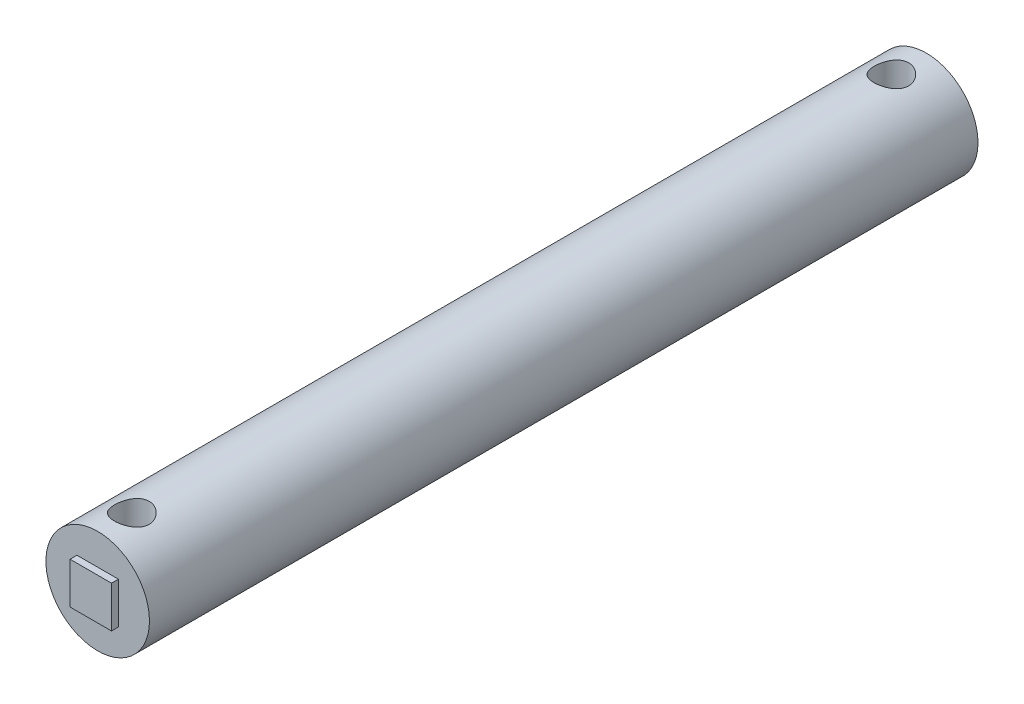
ISO-10303-21;
HEADER;
FILE_DESCRIPTION(('STEP AP214'),'2;1');
FILE_NAME('part.step','',(''),(''),'','','');
FILE_SCHEMA(('AUTOMOTIVE_DESIGN { 1 0 10303 214 1 1 1 1 }'));
ENDSEC;
DATA;
#1=APPLICATION_CONTEXT('core data for automotive mechanical design processes');
#2=APPLICATION_PROTOCOL_DEFINITION('international standard','automotive_design',2000,#1);
#3=PRODUCT_CONTEXT('',#1,'mechanical');
#4=PRODUCT('Part','Part','',(#3));
#5=PRODUCT_RELATED_PRODUCT_CATEGORY('part','',(#4));
#6=PRODUCT_DEFINITION_FORMATION('','',#4);
#7=PRODUCT_DEFINITION_CONTEXT('part definition',#1,'design');
#8=PRODUCT_DEFINITION('design','',#6,#7);
#9=PRODUCT_DEFINITION_SHAPE('','',#8);
#10=(LENGTH_UNIT() NAMED_UNIT(*) SI_UNIT(.MILLI.,.METRE.));
#11=(NAMED_UNIT(*) PLANE_ANGLE_UNIT() SI_UNIT($,.RADIAN.));
#12=(NAMED_UNIT(*) SI_UNIT($,.STERADIAN.) SOLID_ANGLE_UNIT());
#13=UNCERTAINTY_MEASURE_WITH_UNIT(LENGTH_MEASURE(1.E-05),#10,'distance_accuracy_value','');
#14=(GEOMETRIC_REPRESENTATION_CONTEXT(3) GLOBAL_UNCERTAINTY_ASSIGNED_CONTEXT((#13)) GLOBAL_UNIT_ASSIGNED_CONTEXT((#10,
#11,#12)) REPRESENTATION_CONTEXT('',''));
#15=CARTESIAN_POINT('',(0.,0.,0.));
#16=DIRECTION('',(0.,0.,1.));
#17=DIRECTION('',(1.,0.,0.));
#18=AXIS2_PLACEMENT_3D('',#15,#16,#17);
#19=CARTESIAN_POINT('',(0.,0.,60.));
#20=DIRECTION('',(0.,0.,-1.));
#21=DIRECTION('',(-1.,0.,0.));
#22=AXIS2_PLACEMENT_3D('',#19,#20,#21);
#23=CYLINDRICAL_SURFACE('',#22,7.5);
#24=CARTESIAN_POINT('',(2.44548962202173,7.09010440745297,115.));
#25=CARTESIAN_POINT('',(2.44549022489282,7.09010399158785,115.13639194743));
#26=CARTESIAN_POINT('',(2.43429071197438,7.09399673344019,115.272780243976));
#27=CARTESIAN_POINT('',(2.38993391279918,7.10906127410884,115.541523148788));
#28=CARTESIAN_POINT('',(2.35677313743169,7.12023422956957,115.673877112601));
#29=CARTESIAN_POINT('',(2.26977176414744,7.14844063378442,115.930622167149));
#30=CARTESIAN_POINT('',(2.21597015629796,7.1654630267975,116.055027758425));
#31=CARTESIAN_POINT('',(2.08934177443543,7.20340224421352,116.293092114063));
#32=CARTESIAN_POINT('',(2.01651089069817,7.22431990959193,116.406748549715));
#33=CARTESIAN_POINT('',(1.85095347245155,7.26853096468038,116.624354715124));
#34=CARTESIAN_POINT('',(1.75763330927719,7.29188103540003,116.727841431005));
#35=CARTESIAN_POINT('',(1.55500738388795,7.33776050614127,116.918010037244));
#36=CARTESIAN_POINT('',(1.44569927887343,7.36028978528245,117.004689460403));
#37=CARTESIAN_POINT('',(1.2109692056893,7.4025730580127,117.160760524351));
#38=CARTESIAN_POINT('',(1.08522579609347,7.42224829192345,117.229691915553));
#39=CARTESIAN_POINT('',(0.823161350143599,7.45585839282917,117.345246921666));
#40=CARTESIAN_POINT('',(0.68684322862981,7.46979483504472,117.391876658646));
#41=CARTESIAN_POINT('',(0.4126030442508,7.48985898254732,117.459889309561));
#42=CARTESIAN_POINT('',(0.274906075525262,7.49624412402236,117.482102609449));
#43=CARTESIAN_POINT('',(-0.00239025035411809,7.50128017614413,117.503319122196));
#44=CARTESIAN_POINT('',(-0.141989133421975,7.49993298025629,117.502328017079));
#45=CARTESIAN_POINT('',(-0.413573557882291,7.48977600308497,117.477694740615));
#46=CARTESIAN_POINT('',(-0.545648242696176,7.48124808485107,117.454903743357));
#47=CARTESIAN_POINT('',(-0.803947464109366,7.45791492488888,117.388749195508));
#48=CARTESIAN_POINT('',(-0.93017154885925,7.44310919921052,117.345384058847));
#49=CARTESIAN_POINT('',(-1.17542351309193,7.40837131189626,117.23868567036));
#50=CARTESIAN_POINT('',(-1.29431235086316,7.38836443881961,117.175058083416));
#51=CARTESIAN_POINT('',(-1.51997789988009,7.3452627587628,117.029881507955));
#52=CARTESIAN_POINT('',(-1.62675112718097,7.32216706770583,116.948327384216));
#53=CARTESIAN_POINT('',(-1.83057863879854,7.27395899041506,116.765009088026));
#54=CARTESIAN_POINT('',(-1.92692004190617,7.24880301897135,116.662462506802));
#55=CARTESIAN_POINT('',(-2.10125174746113,7.20020497610945,116.442413525832));
#56=CARTESIAN_POINT('',(-2.17923926629671,7.17676316503772,116.324908861652));
#57=CARTESIAN_POINT('',(-2.31552096142186,7.13397168411738,116.076193479134));
#58=CARTESIAN_POINT('',(-2.37354333743111,7.11467973815026,115.944823164307));
#59=CARTESIAN_POINT('',(-2.46638890271202,7.08303331303905,115.673347576634));
#60=CARTESIAN_POINT('',(-2.50122240574045,7.07067575006161,115.533246217474));
#61=CARTESIAN_POINT('',(-2.54520764292867,7.05495856309845,115.255446587488));
#62=CARTESIAN_POINT('',(-2.55550478809578,7.05119797792599,115.11795228751));
#63=CARTESIAN_POINT('',(-2.55336489271969,7.05197367185134,114.843179582597));
#64=CARTESIAN_POINT('',(-2.54093209201698,7.05650840361514,114.705901142179));
#65=CARTESIAN_POINT('',(-2.49469693464315,7.07298000520337,114.440545245723));
#66=CARTESIAN_POINT('',(-2.46167014462677,7.0846479402767,114.312314191716));
#67=CARTESIAN_POINT('',(-2.37611223081313,7.11379780932038,114.063243273428));
#68=CARTESIAN_POINT('',(-2.32357757619856,7.13128079572361,113.94240475177));
#69=CARTESIAN_POINT('',(-2.19852414714674,7.17083790960198,113.707119688578));
#70=CARTESIAN_POINT('',(-2.12540165401872,7.19304480808356,113.593016940712));
#71=CARTESIAN_POINT('',(-1.96194569674786,7.23933516292333,113.378300588077));
#72=CARTESIAN_POINT('',(-1.87160697732508,7.26341919094806,113.277691118169));
#73=CARTESIAN_POINT('',(-1.67086899539885,7.31227591777891,113.087555651541));
#74=CARTESIAN_POINT('',(-1.55968626362084,7.33702184669254,112.998847501519));
#75=CARTESIAN_POINT('',(-1.32342110908038,7.38329377082801,112.841291510042));
#76=CARTESIAN_POINT('',(-1.19833899382816,7.40481983726143,112.772443229328));
#77=CARTESIAN_POINT('',(-0.938234823790851,7.44223552717528,112.657105018691));
#78=CARTESIAN_POINT('',(-0.803268004154795,7.45815395764301,112.610500368921));
#79=CARTESIAN_POINT('',(-0.526760889959159,7.48276379089851,112.540877235034));
#80=CARTESIAN_POINT('',(-0.38522303395312,7.4914578524143,112.517850073155));
#81=CARTESIAN_POINT('',(-0.10686265311105,7.5004698666747,112.496840788176));
#82=CARTESIAN_POINT('',(0.0298621000756927,7.50116813862013,112.497714713752));
#83=CARTESIAN_POINT('',(0.301170903663914,7.49517865490161,112.521687662539));
#84=CARTESIAN_POINT('',(0.435755150824566,7.48849158213902,112.544784630825));
#85=CARTESIAN_POINT('',(0.696539697144409,7.46871113716691,112.611751613715));
#86=CARTESIAN_POINT('',(0.822846962464736,7.45573460945831,112.655242295593));
#87=CARTESIAN_POINT('',(1.06644072417718,7.42480946813606,112.761444124562));
#88=CARTESIAN_POINT('',(1.18372565428804,7.4068599936943,112.824158599533));
#89=CARTESIAN_POINT('',(1.41046977121198,7.36710923714644,112.969578897944));
#90=CARTESIAN_POINT('',(1.51950571915653,7.34519421778484,113.052913081802));
#91=CARTESIAN_POINT('',(1.72242098955527,7.30027986905304,113.236136757535));
#92=CARTESIAN_POINT('',(1.81629557036969,7.2772802033596,113.336031408895));
#93=CARTESIAN_POINT('',(1.98995212670324,7.23176840182728,113.554193519779));
#94=CARTESIAN_POINT('',(2.06904027392138,7.20931041492086,113.673026286671));
#95=CARTESIAN_POINT('',(2.20608486621925,7.16856512489781,113.922963570356));
#96=CARTESIAN_POINT('',(2.26404642024053,7.15027681384981,114.054065110601));
#97=CARTESIAN_POINT('',(2.35490928722307,7.12085667779552,114.319197210166));
#98=CARTESIAN_POINT('',(2.3887669319706,7.10945485829763,114.452869297742));
#99=CARTESIAN_POINT('',(2.43405309060397,7.09408016011375,114.724363089999));
#100=CARTESIAN_POINT('',(2.44548901285352,7.09010482766189,114.862183408775));
#101=CARTESIAN_POINT('',(2.44548962202173,7.09010440745297,115.));
#102=B_SPLINE_CURVE_WITH_KNOTS('',3,(#24,#25,#26,#27,#28,#29,#30,#31,#32,#33,#34,#35,#36,#37,
#38,#39,#40,#41,#42,#43,#44,#45,#46,#47,#48,#49,#50,#51,#52,#53,#54,#55,#56,#57,#58,#59,#60,#61,
#62,#63,#64,#65,#66,#67,#68,#69,#70,#71,#72,#73,#74,#75,#76,#77,#78,#79,#80,#81,#82,#83,#84,#85,
#86,#87,#88,#89,#90,#91,#92,#93,#94,#95,#96,#97,#98,#99,#100,#101),.UNSPECIFIED.,.T.,.F.,(4,2,2,
2,2,2,2,2,2,2,2,2,2,2,2,2,2,2,2,2,2,2,2,2,2,2,2,2,2,2,2,2,2,2,2,2,2,2,4),(0.,0.408666423219487,
0.817397789180034,1.22536084238349,1.63341207568901,2.05537445189343,2.47739872259067,
2.90946129115628,3.34140518521897,3.75815500010449,4.17480276723174,4.57581954452084,
4.97686724142531,5.38402890391776,5.79130735400781,6.21814264244295,6.64504262449434,
7.07754352039463,7.50985192334124,7.92154604151629,8.33316337379327,8.73014463325997,
9.12719777922344,9.53738861730053,9.94770486791145,10.3787720534343,10.8098297039168,
11.2386395189751,11.6672914525279,12.0754648597695,12.4836005275617,12.884428777574,
13.2853264552439,13.700396784995,14.1155966755397,14.5470171461539,14.9783332191223,
15.3914047587577,15.8043397923661),.UNSPECIFIED.);
#103=CARTESIAN_POINT('',(2.44548962202173,7.09010440745297,115.));
#104=VERTEX_POINT('',#103);
#105=EDGE_CURVE('E39',#104,#104,#102,.T.);
#106=ORIENTED_EDGE('',*,*,#105,.T.);
#107=EDGE_LOOP('',(#106));
#108=FACE_BOUND('',#107,.T.);
#109=CARTESIAN_POINT('',(2.44548962202173,-7.09010440745297,115.));
#110=CARTESIAN_POINT('',(2.44549022489282,-7.09010399158785,114.86360805257));
#111=CARTESIAN_POINT('',(2.43429071197437,-7.09399673344019,114.727219756024));
#112=CARTESIAN_POINT('',(2.38993391279918,-7.10906127410884,114.458476851212));
#113=CARTESIAN_POINT('',(2.35677313743169,-7.12023422956957,114.326122887399));
#114=CARTESIAN_POINT('',(2.26977176414743,-7.14844063378442,114.069377832851));
#115=CARTESIAN_POINT('',(2.21597015629796,-7.1654630267975,113.944972241575));
#116=CARTESIAN_POINT('',(2.08934177443543,-7.20340224421352,113.706907885937));
#117=CARTESIAN_POINT('',(2.01651089069817,-7.22431990959193,113.593251450285));
#118=CARTESIAN_POINT('',(1.85095347245155,-7.26853096468038,113.375645284876));
#119=CARTESIAN_POINT('',(1.75763330927718,-7.29188103540003,113.272158568995));
#120=CARTESIAN_POINT('',(1.55500738388794,-7.33776050614128,113.081989962756));
#121=CARTESIAN_POINT('',(1.44569927887343,-7.36028978528245,112.995310539597));
#122=CARTESIAN_POINT('',(1.2109692056893,-7.4025730580127,112.839239475649));
#123=CARTESIAN_POINT('',(1.08522579609347,-7.42224829192345,112.770308084447));
#124=CARTESIAN_POINT('',(0.823161350143598,-7.45585839282917,112.654753078334));
#125=CARTESIAN_POINT('',(0.686843228629809,-7.46979483504472,112.608123341354));
#126=CARTESIAN_POINT('',(0.412603044250799,-7.48985898254732,112.540110690439));
#127=CARTESIAN_POINT('',(0.27490607552526,-7.49624412402236,112.517897390551));
#128=CARTESIAN_POINT('',(-0.00239025035412009,-7.50128017614413,112.496680877804));
#129=CARTESIAN_POINT('',(-0.141989133421976,-7.49993298025629,112.497671982921));
#130=CARTESIAN_POINT('',(-0.413573557882292,-7.48977600308497,112.522305259385));
#131=CARTESIAN_POINT('',(-0.545648242696178,-7.48124808485107,112.545096256643));
#132=CARTESIAN_POINT('',(-0.803947464109367,-7.45791492488888,112.611250804492));
#133=CARTESIAN_POINT('',(-0.930171548859251,-7.44310919921052,112.654615941153));
#134=CARTESIAN_POINT('',(-1.17542351309193,-7.40837131189626,112.76131432964));
#135=CARTESIAN_POINT('',(-1.29431235086316,-7.38836443881961,112.824941916584));
#136=CARTESIAN_POINT('',(-1.51997789988009,-7.3452627587628,112.970118492045));
#137=CARTESIAN_POINT('',(-1.62675112718097,-7.32216706770583,113.051672615784));
#138=CARTESIAN_POINT('',(-1.83057863879854,-7.27395899041506,113.234990911974));
#139=CARTESIAN_POINT('',(-1.92692004190616,-7.24880301897135,113.337537493198));
#140=CARTESIAN_POINT('',(-2.10125174746112,-7.20020497610945,113.557586474168));
#141=CARTESIAN_POINT('',(-2.17923926629671,-7.17676316503772,113.675091138348));
#142=CARTESIAN_POINT('',(-2.31552096142186,-7.13397168411738,113.923806520866));
#143=CARTESIAN_POINT('',(-2.37354333743111,-7.11467973815026,114.055176835693));
#144=CARTESIAN_POINT('',(-2.46638890271202,-7.08303331303905,114.326652423366));
#145=CARTESIAN_POINT('',(-2.50122240574045,-7.07067575006161,114.466753782526));
#146=CARTESIAN_POINT('',(-2.54520764292867,-7.05495856309845,114.744553412512));
#147=CARTESIAN_POINT('',(-2.55550478809578,-7.05119797792599,114.88204771249));
#148=CARTESIAN_POINT('',(-2.55336489271969,-7.05197367185134,115.156820417403));
#149=CARTESIAN_POINT('',(-2.54093209201698,-7.05650840361514,115.294098857821));
#150=CARTESIAN_POINT('',(-2.49469693464315,-7.07298000520337,115.559454754277));
#151=CARTESIAN_POINT('',(-2.46167014462677,-7.08464794027671,115.687685808284));
#152=CARTESIAN_POINT('',(-2.37611223081313,-7.11379780932039,115.936756726572));
#153=CARTESIAN_POINT('',(-2.32357757619856,-7.13128079572361,116.05759524823));
#154=CARTESIAN_POINT('',(-2.19852414714674,-7.17083790960198,116.292880311422));
#155=CARTESIAN_POINT('',(-2.12540165401872,-7.19304480808356,116.406983059288));
#156=CARTESIAN_POINT('',(-1.96194569674786,-7.23933516292333,116.621699411923));
#157=CARTESIAN_POINT('',(-1.87160697732508,-7.26341919094806,116.722308881831));
#158=CARTESIAN_POINT('',(-1.67086899539885,-7.31227591777891,116.912444348459));
#159=CARTESIAN_POINT('',(-1.55968626362084,-7.33702184669254,117.001152498481));
#160=CARTESIAN_POINT('',(-1.32342110908039,-7.38329377082801,117.158708489958));
#161=CARTESIAN_POINT('',(-1.19833899382816,-7.40481983726143,117.227556770672));
#162=CARTESIAN_POINT('',(-0.938234823790852,-7.44223552717528,117.342894981309));
#163=CARTESIAN_POINT('',(-0.803268004154796,-7.45815395764301,117.389499631079));
#164=CARTESIAN_POINT('',(-0.52676088995916,-7.48276379089851,117.459122764966));
#165=CARTESIAN_POINT('',(-0.385223033953121,-7.4914578524143,117.482149926845));
#166=CARTESIAN_POINT('',(-0.106862653111051,-7.5004698666747,117.503159211824));
#167=CARTESIAN_POINT('',(0.0298621000756914,-7.50116813862013,117.502285286248));
#168=CARTESIAN_POINT('',(0.301170903663913,-7.49517865490161,117.478312337461));
#169=CARTESIAN_POINT('',(0.435755150824565,-7.48849158213902,117.455215369175));
#170=CARTESIAN_POINT('',(0.696539697144408,-7.46871113716691,117.388248386285));
#171=CARTESIAN_POINT('',(0.822846962464734,-7.45573460945831,117.344757704407));
#172=CARTESIAN_POINT('',(1.06644072417718,-7.42480946813606,117.238555875438));
#173=CARTESIAN_POINT('',(1.18372565428804,-7.4068599936943,117.175841400467));
#174=CARTESIAN_POINT('',(1.41046977121198,-7.36710923714644,117.030421102056));
#175=CARTESIAN_POINT('',(1.51950571915653,-7.34519421778484,116.947086918198));
#176=CARTESIAN_POINT('',(1.72242098955527,-7.30027986905304,116.763863242465));
#177=CARTESIAN_POINT('',(1.81629557036969,-7.2772802033596,116.663968591105));
#178=CARTESIAN_POINT('',(1.98995212670324,-7.23176840182728,116.445806480221));
#179=CARTESIAN_POINT('',(2.06904027392138,-7.20931041492086,116.326973713329));
#180=CARTESIAN_POINT('',(2.20608486621925,-7.16856512489781,116.077036429644));
#181=CARTESIAN_POINT('',(2.26404642024053,-7.15027681384981,115.945934889399));
#182=CARTESIAN_POINT('',(2.35490928722306,-7.12085667779552,115.680802789834));
#183=CARTESIAN_POINT('',(2.3887669319706,-7.10945485829763,115.547130702258));
#184=CARTESIAN_POINT('',(2.43405309060397,-7.09408016011375,115.275636910001));
#185=CARTESIAN_POINT('',(2.44548901285352,-7.09010482766189,115.137816591225));
#186=CARTESIAN_POINT('',(2.44548962202173,-7.09010440745297,115.));
#187=B_SPLINE_CURVE_WITH_KNOTS('',3,(#109,#110,#111,#112,#113,#114,#115,#116,#117,#118,#119,
#120,#121,#122,#123,#124,#125,#126,#127,#128,#129,#130,#131,#132,#133,#134,#135,#136,#137,#138,
#139,#140,#141,#142,#143,#144,#145,#146,#147,#148,#149,#150,#151,#152,#153,#154,#155,#156,#157,
#158,#159,#160,#161,#162,#163,#164,#165,#166,#167,#168,#169,#170,#171,#172,#173,#174,#175,#176,
#177,#178,#179,#180,#181,#182,#183,#184,#185,#186),.UNSPECIFIED.,.T.,.F.,(4,2,2,2,2,2,2,2,2,2,2,
2,2,2,2,2,2,2,2,2,2,2,2,2,2,2,2,2,2,2,2,2,2,2,2,2,2,2,4),(0.,0.408666423219487,
0.817397789180034,1.22536084238349,1.63341207568901,2.05537445189344,2.47739872259067,
2.90946129115628,3.34140518521897,3.75815500010449,4.17480276723174,4.57581954452084,
4.97686724142531,5.38402890391777,5.79130735400781,6.21814264244293,6.64504262449434,
7.07754352039463,7.50985192334124,7.92154604151629,8.33316337379327,8.73014463325998,
9.12719777922343,9.53738861730053,9.94770486791145,10.3787720534343,10.8098297039168,
11.2386395189751,11.6672914525279,12.0754648597695,12.4836005275617,12.884428777574,
13.2853264552439,13.700396784995,14.1155966755397,14.5470171461539,14.9783332191223,
15.3914047587577,15.8043397923661),.UNSPECIFIED.);
#188=CARTESIAN_POINT('',(2.44548962202173,-7.09010440745297,115.));
#189=VERTEX_POINT('',#188);
#190=EDGE_CURVE('E12',#189,#189,#187,.T.);
#191=ORIENTED_EDGE('',*,*,#190,.T.);
#192=EDGE_LOOP('',(#191));
#193=FACE_BOUND('',#192,.T.);
#194=CARTESIAN_POINT('',(2.44548962202173,-7.09010440745297,5.));
#195=CARTESIAN_POINT('',(2.44549022489282,-7.09010399158785,5.13639194743031));
#196=CARTESIAN_POINT('',(2.43429071197437,-7.09399673344019,5.27278024397561));
#197=CARTESIAN_POINT('',(2.38993391279918,-7.10906127410884,5.54152314878753));
#198=CARTESIAN_POINT('',(2.35677313743169,-7.12023422956957,5.67387711260106));
#199=CARTESIAN_POINT('',(2.26977176414743,-7.14844063378442,5.93062216714861));
#200=CARTESIAN_POINT('',(2.21597015629795,-7.1654630267975,6.05502775842536));
#201=CARTESIAN_POINT('',(2.08934177443543,-7.20340224421353,6.29309211406347));
#202=CARTESIAN_POINT('',(2.01651089069816,-7.22431990959193,6.40674854971531));
#203=CARTESIAN_POINT('',(1.85095347245154,-7.26853096468038,6.62435471512369));
#204=CARTESIAN_POINT('',(1.75763330927717,-7.29188103540003,6.7278414310049));
#205=CARTESIAN_POINT('',(1.55500738388793,-7.33776050614128,6.9180100372445));
#206=CARTESIAN_POINT('',(1.44569927887342,-7.36028978528246,7.00468946040261));
#207=CARTESIAN_POINT('',(1.21096920568929,-7.4025730580127,7.16076052435056));
#208=CARTESIAN_POINT('',(1.08522579609346,-7.42224829192345,7.22969191555345));
#209=CARTESIAN_POINT('',(0.823161350143589,-7.45585839282917,7.34524692166592));
#210=CARTESIAN_POINT('',(0.686843228629803,-7.46979483504472,7.39187665864566));
#211=CARTESIAN_POINT('',(0.412603044250796,-7.48985898254732,7.45988930956071));
#212=CARTESIAN_POINT('',(0.274906075525258,-7.49624412402236,7.48210260944859));
#213=CARTESIAN_POINT('',(-0.00239025035412093,-7.50128017614413,7.50331912219593));
#214=CARTESIAN_POINT('',(-0.141989133421976,-7.49993298025629,7.50232801707899));
#215=CARTESIAN_POINT('',(-0.413573557882292,-7.48977600308497,7.47769474061521));
#216=CARTESIAN_POINT('',(-0.545648242696178,-7.48124808485106,7.45490374335685));
#217=CARTESIAN_POINT('',(-0.803947464109368,-7.45791492488887,7.38874919550846));
#218=CARTESIAN_POINT('',(-0.930171548859252,-7.44310919921052,7.34538405884736));
#219=CARTESIAN_POINT('',(-1.17542351309193,-7.40837131189626,7.23868567036026));
#220=CARTESIAN_POINT('',(-1.29431235086316,-7.38836443881961,7.17505808341564));
#221=CARTESIAN_POINT('',(-1.51997789988009,-7.3452627587628,7.02988150795489));
#222=CARTESIAN_POINT('',(-1.62675112718097,-7.32216706770583,6.94832738421558));
#223=CARTESIAN_POINT('',(-1.83057863879854,-7.27395899041506,6.76500908802565));
#224=CARTESIAN_POINT('',(-1.92692004190617,-7.24880301897135,6.66246250680167));
#225=CARTESIAN_POINT('',(-2.10125174746114,-7.20020497610945,6.4424135258318));
#226=CARTESIAN_POINT('',(-2.17923926629672,-7.17676316503772,6.32490886165159));
#227=CARTESIAN_POINT('',(-2.31552096142186,-7.13397168411738,6.07619347913402));
#228=CARTESIAN_POINT('',(-2.37354333743111,-7.11467973815026,5.94482316430727));
#229=CARTESIAN_POINT('',(-2.46638890271202,-7.08303331303905,5.6733475766341));
#230=CARTESIAN_POINT('',(-2.50122240574045,-7.07067575006161,5.53324621747375));
#231=CARTESIAN_POINT('',(-2.54520764292867,-7.05495856309845,5.25544658748839));
#232=CARTESIAN_POINT('',(-2.55550478809578,-7.05119797792599,5.1179522875096));
#233=CARTESIAN_POINT('',(-2.55336489271969,-7.05197367185134,4.84317958259682));
#234=CARTESIAN_POINT('',(-2.54093209201698,-7.05650840361514,4.70590114217878));
#235=CARTESIAN_POINT('',(-2.49469693464315,-7.07298000520337,4.44054524572253));
#236=CARTESIAN_POINT('',(-2.46167014462677,-7.0846479402767,4.31231419171557));
#237=CARTESIAN_POINT('',(-2.37611223081313,-7.11379780932038,4.06324327342803));
#238=CARTESIAN_POINT('',(-2.32357757619856,-7.13128079572361,3.94240475176996));
#239=CARTESIAN_POINT('',(-2.19852414714674,-7.17083790960198,3.70711968857802));
#240=CARTESIAN_POINT('',(-2.12540165401872,-7.19304480808356,3.59301694071223));
#241=CARTESIAN_POINT('',(-1.96194569674786,-7.23933516292333,3.3783005880766));
#242=CARTESIAN_POINT('',(-1.87160697732508,-7.26341919094806,3.27769111816937));
#243=CARTESIAN_POINT('',(-1.67086899539885,-7.31227591777891,3.08755565154133));
#244=CARTESIAN_POINT('',(-1.55968626362083,-7.33702184669255,2.99884750151911));
#245=CARTESIAN_POINT('',(-1.32342110908038,-7.38329377082801,2.84129151004178));
#246=CARTESIAN_POINT('',(-1.19833899382815,-7.40481983726143,2.77244322932768));
#247=CARTESIAN_POINT('',(-0.938234823790843,-7.44223552717528,2.65710501869135));
#248=CARTESIAN_POINT('',(-0.803268004154789,-7.45815395764302,2.61050036892064));
#249=CARTESIAN_POINT('',(-0.526760889959158,-7.48276379089851,2.54087723503441));
#250=CARTESIAN_POINT('',(-0.385223033953122,-7.4914578524143,2.51785007315525));
#251=CARTESIAN_POINT('',(-0.106862653111053,-7.5004698666747,2.4968407881757));
#252=CARTESIAN_POINT('',(0.0298621000756898,-7.50116813862013,2.49771471375203));
#253=CARTESIAN_POINT('',(0.301170903663912,-7.49517865490161,2.52168766253943));
#254=CARTESIAN_POINT('',(0.435755150824563,-7.48849158213902,2.54478463082486));
#255=CARTESIAN_POINT('',(0.696539697144407,-7.46871113716691,2.61175161371507));
#256=CARTESIAN_POINT('',(0.822846962464735,-7.45573460945831,2.65524229559347));
#257=CARTESIAN_POINT('',(1.06644072417718,-7.42480946813606,2.76144412456193));
#258=CARTESIAN_POINT('',(1.18372565428804,-7.4068599936943,2.82415859953339));
#259=CARTESIAN_POINT('',(1.41046977121198,-7.36710923714644,2.96957889794373));
#260=CARTESIAN_POINT('',(1.51950571915653,-7.34519421778484,3.0529130818016));
#261=CARTESIAN_POINT('',(1.72242098955527,-7.30027986905304,3.23613675753537));
#262=CARTESIAN_POINT('',(1.81629557036969,-7.2772802033596,3.33603140889522));
#263=CARTESIAN_POINT('',(1.98995212670324,-7.23176840182728,3.55419351977918));
#264=CARTESIAN_POINT('',(2.06904027392138,-7.20931041492086,3.67302628667051));
#265=CARTESIAN_POINT('',(2.20608486621925,-7.16856512489781,3.92296357035552));
#266=CARTESIAN_POINT('',(2.26404642024053,-7.15027681384981,4.05406511060094));
#267=CARTESIAN_POINT('',(2.35490928722307,-7.12085667779552,4.31919721016551));
#268=CARTESIAN_POINT('',(2.3887669319706,-7.10945485829762,4.45286929774164));
#269=CARTESIAN_POINT('',(2.43405309060397,-7.09408016011375,4.72436308999891));
#270=CARTESIAN_POINT('',(2.44548901285352,-7.09010482766189,4.86218340877541));
#271=CARTESIAN_POINT('',(2.44548962202173,-7.09010440745297,5.));
#272=B_SPLINE_CURVE_WITH_KNOTS('',3,(#194,#195,#196,#197,#198,#199,#200,#201,#202,#203,#204,
#205,#206,#207,#208,#209,#210,#211,#212,#213,#214,#215,#216,#217,#218,#219,#220,#221,#222,#223,
#224,#225,#226,#227,#228,#229,#230,#231,#232,#233,#234,#235,#236,#237,#238,#239,#240,#241,#242,
#243,#244,#245,#246,#247,#248,#249,#250,#251,#252,#253,#254,#255,#256,#257,#258,#259,#260,#261,
#262,#263,#264,#265,#266,#267,#268,#269,#270,#271),.UNSPECIFIED.,.T.,.F.,(4,2,2,2,2,2,2,2,2,2,2,
2,2,2,2,2,2,2,2,2,2,2,2,2,2,2,2,2,2,2,2,2,2,2,2,2,2,2,4),(0.,0.408666423219492,
0.817397789180036,1.22536084238349,1.63341207568902,2.05537445189345,2.47739872259068,
2.90946129115629,3.34140518521898,3.75815500010449,4.17480276723174,4.57581954452084,
4.97686724142531,5.38402890391776,5.79130735400782,6.21814264244295,6.64504262449435,
7.07754352039462,7.50985192334123,7.92154604151629,8.33316337379325,8.73014463325997,
9.12719777922344,9.53738861730053,9.94770486791146,10.3787720534343,10.8098297039169,
11.2386395189751,11.6672914525279,12.0754648597695,12.4836005275617,12.884428777574,
13.2853264552439,13.700396784995,14.1155966755397,14.5470171461539,14.9783332191223,
15.3914047587577,15.8043397923661),.UNSPECIFIED.);
#273=CARTESIAN_POINT('',(2.44548962202173,-7.09010440745297,5.));
#274=VERTEX_POINT('',#273);
#275=EDGE_CURVE('E47',#274,#274,#272,.T.);
#276=ORIENTED_EDGE('',*,*,#275,.F.);
#277=EDGE_LOOP('',(#276));
#278=FACE_BOUND('',#277,.T.);
#279=CARTESIAN_POINT('',(0.,0.,0.));
#280=DIRECTION('',(0.,0.,1.));
#281=DIRECTION('',(1.,0.,0.));
#282=AXIS2_PLACEMENT_3D('',#279,#280,#281);
#283=CIRCLE('',#282,7.5);
#284=CARTESIAN_POINT('',(7.5,0.,0.));
#285=VERTEX_POINT('',#284);
#286=EDGE_CURVE('E178',#285,#285,#283,.T.);
#287=ORIENTED_EDGE('',*,*,#286,.T.);
#288=EDGE_LOOP('',(#287));
#289=FACE_BOUND('',#288,.T.);
#290=CARTESIAN_POINT('',(2.44548962202173,7.09010440745297,5.));
#291=CARTESIAN_POINT('',(2.44549022489282,7.09010399158785,4.86360805256969));
#292=CARTESIAN_POINT('',(2.43429071197438,7.09399673344019,4.72721975602439));
#293=CARTESIAN_POINT('',(2.38993391279918,7.10906127410884,4.45847685121247));
#294=CARTESIAN_POINT('',(2.35677313743169,7.12023422956957,4.32612288739894));
#295=CARTESIAN_POINT('',(2.26977176414743,7.14844063378442,4.06937783285139));
#296=CARTESIAN_POINT('',(2.21597015629795,7.1654630267975,3.94497224157464));
#297=CARTESIAN_POINT('',(2.08934177443543,7.20340224421352,3.70690788593653));
#298=CARTESIAN_POINT('',(2.01651089069816,7.22431990959193,3.59325145028469));
#299=CARTESIAN_POINT('',(1.85095347245154,7.26853096468038,3.37564528487631));
#300=CARTESIAN_POINT('',(1.75763330927717,7.29188103540003,3.2721585689951));
#301=CARTESIAN_POINT('',(1.55500738388793,7.33776050614128,3.0819899627555));
#302=CARTESIAN_POINT('',(1.44569927887342,7.36028978528246,2.99531053959739));
#303=CARTESIAN_POINT('',(1.21096920568929,7.4025730580127,2.83923947564944));
#304=CARTESIAN_POINT('',(1.08522579609346,7.42224829192345,2.77030808444655));
#305=CARTESIAN_POINT('',(0.823161350143589,7.45585839282917,2.65475307833408));
#306=CARTESIAN_POINT('',(0.686843228629804,7.46979483504472,2.60812334135434));
#307=CARTESIAN_POINT('',(0.412603044250797,7.48985898254732,2.54011069043929));
#308=CARTESIAN_POINT('',(0.274906075525259,7.49624412402236,2.51789739055141));
#309=CARTESIAN_POINT('',(-0.00239025035412009,7.50128017614413,2.49668087780407));
#310=CARTESIAN_POINT('',(-0.141989133421976,7.49993298025629,2.49767198292101));
#311=CARTESIAN_POINT('',(-0.413573557882291,7.48977600308497,2.52230525938479));
#312=CARTESIAN_POINT('',(-0.545648242696177,7.48124808485107,2.54509625664315));
#313=CARTESIAN_POINT('',(-0.803947464109367,7.45791492488887,2.61125080449154));
#314=CARTESIAN_POINT('',(-0.930171548859251,7.44310919921052,2.65461594115264));
#315=CARTESIAN_POINT('',(-1.17542351309193,7.40837131189626,2.76131432963974));
#316=CARTESIAN_POINT('',(-1.29431235086316,7.38836443881961,2.82494191658436));
#317=CARTESIAN_POINT('',(-1.51997789988009,7.3452627587628,2.97011849204512));
#318=CARTESIAN_POINT('',(-1.62675112718097,7.32216706770583,3.05167261578442));
#319=CARTESIAN_POINT('',(-1.83057863879854,7.27395899041506,3.23499091197435));
#320=CARTESIAN_POINT('',(-1.92692004190617,7.24880301897135,3.33753749319834));
#321=CARTESIAN_POINT('',(-2.10125174746114,7.20020497610945,3.5575864741682));
#322=CARTESIAN_POINT('',(-2.17923926629672,7.17676316503772,3.67509113834841));
#323=CARTESIAN_POINT('',(-2.31552096142186,7.13397168411738,3.92380652086598));
#324=CARTESIAN_POINT('',(-2.37354333743111,7.11467973815026,4.05517683569273));
#325=CARTESIAN_POINT('',(-2.46638890271202,7.08303331303905,4.3266524233659));
#326=CARTESIAN_POINT('',(-2.50122240574045,7.07067575006161,4.46675378252625));
#327=CARTESIAN_POINT('',(-2.54520764292867,7.05495856309845,4.74455341251161));
#328=CARTESIAN_POINT('',(-2.55550478809578,7.05119797792599,4.8820477124904));
#329=CARTESIAN_POINT('',(-2.55336489271969,7.05197367185134,5.15682041740318));
#330=CARTESIAN_POINT('',(-2.54093209201698,7.05650840361514,5.29409885782122));
#331=CARTESIAN_POINT('',(-2.49469693464315,7.07298000520337,5.55945475427747));
#332=CARTESIAN_POINT('',(-2.46167014462677,7.0846479402767,5.68768580828444));
#333=CARTESIAN_POINT('',(-2.37611223081313,7.11379780932038,5.93675672657197));
#334=CARTESIAN_POINT('',(-2.32357757619856,7.13128079572361,6.05759524823004));
#335=CARTESIAN_POINT('',(-2.19852414714674,7.17083790960198,6.29288031142199));
#336=CARTESIAN_POINT('',(-2.12540165401872,7.19304480808356,6.40698305928778));
#337=CARTESIAN_POINT('',(-1.96194569674786,7.23933516292333,6.6216994119234));
#338=CARTESIAN_POINT('',(-1.87160697732507,7.26341919094806,6.72230888183063));
#339=CARTESIAN_POINT('',(-1.67086899539885,7.31227591777891,6.91244434845867));
#340=CARTESIAN_POINT('',(-1.55968626362083,7.33702184669255,7.00115249848089));
#341=CARTESIAN_POINT('',(-1.32342110908038,7.38329377082801,7.15870848995822));
#342=CARTESIAN_POINT('',(-1.19833899382815,7.40481983726143,7.22755677067232));
#343=CARTESIAN_POINT('',(-0.938234823790843,7.44223552717528,7.34289498130865));
#344=CARTESIAN_POINT('',(-0.803268004154789,7.45815395764302,7.38949963107936));
#345=CARTESIAN_POINT('',(-0.526760889959157,7.48276379089851,7.45912276496559));
#346=CARTESIAN_POINT('',(-0.385223033953121,7.4914578524143,7.48214992684475));
#347=CARTESIAN_POINT('',(-0.106862653111053,7.5004698666747,7.5031592118243));
#348=CARTESIAN_POINT('',(0.0298621000756906,7.50116813862013,7.50228528624797));
#349=CARTESIAN_POINT('',(0.301170903663912,7.49517865490161,7.47831233746057));
#350=CARTESIAN_POINT('',(0.435755150824563,7.48849158213902,7.45521536917514));
#351=CARTESIAN_POINT('',(0.696539697144408,7.46871113716691,7.38824838628493));
#352=CARTESIAN_POINT('',(0.822846962464736,7.45573460945831,7.34475770440653));
#353=CARTESIAN_POINT('',(1.06644072417718,7.42480946813606,7.23855587543807));
#354=CARTESIAN_POINT('',(1.18372565428804,7.4068599936943,7.17584140046661));
#355=CARTESIAN_POINT('',(1.41046977121198,7.36710923714644,7.03042110205627));
#356=CARTESIAN_POINT('',(1.51950571915653,7.34519421778484,6.9470869181984));
#357=CARTESIAN_POINT('',(1.72242098955527,7.30027986905304,6.76386324246463));
#358=CARTESIAN_POINT('',(1.81629557036969,7.2772802033596,6.66396859110479));
#359=CARTESIAN_POINT('',(1.98995212670324,7.23176840182728,6.44580648022082));
#360=CARTESIAN_POINT('',(2.06904027392138,7.20931041492086,6.32697371332948));
#361=CARTESIAN_POINT('',(2.20608486621925,7.1685651248978,6.07703642964448));
#362=CARTESIAN_POINT('',(2.26404642024053,7.15027681384981,5.94593488939905));
#363=CARTESIAN_POINT('',(2.35490928722307,7.12085667779552,5.68080278983449));
#364=CARTESIAN_POINT('',(2.3887669319706,7.10945485829762,5.54713070225836));
#365=CARTESIAN_POINT('',(2.43405309060397,7.09408016011375,5.27563691000109));
#366=CARTESIAN_POINT('',(2.44548901285352,7.09010482766189,5.13781659122459));
#367=CARTESIAN_POINT('',(2.44548962202173,7.09010440745297,5.));
#368=B_SPLINE_CURVE_WITH_KNOTS('',3,(#290,#291,#292,#293,#294,#295,#296,#297,#298,#299,#300,
#301,#302,#303,#304,#305,#306,#307,#308,#309,#310,#311,#312,#313,#314,#315,#316,#317,#318,#319,
#320,#321,#322,#323,#324,#325,#326,#327,#328,#329,#330,#331,#332,#333,#334,#335,#336,#337,#338,
#339,#340,#341,#342,#343,#344,#345,#346,#347,#348,#349,#350,#351,#352,#353,#354,#355,#356,#357,
#358,#359,#360,#361,#362,#363,#364,#365,#366,#367),.UNSPECIFIED.,.T.,.F.,(4,2,2,2,2,2,2,2,2,2,2,
2,2,2,2,2,2,2,2,2,2,2,2,2,2,2,2,2,2,2,2,2,2,2,2,2,2,2,4),(0.,0.408666423219492,
0.817397789180036,1.22536084238349,1.63341207568902,2.05537445189346,2.47739872259069,
2.90946129115629,3.34140518521898,3.75815500010449,4.17480276723174,4.57581954452084,
4.97686724142531,5.38402890391776,5.79130735400781,6.21814264244295,6.64504262449435,
7.07754352039462,7.50985192334123,7.92154604151629,8.33316337379325,8.73014463325997,
9.12719777922344,9.53738861730053,9.94770486791146,10.3787720534343,10.8098297039169,
11.2386395189751,11.6672914525279,12.0754648597695,12.4836005275617,12.884428777574,
13.2853264552439,13.700396784995,14.1155966755397,14.5470171461539,14.9783332191223,
15.3914047587577,15.8043397923661),.UNSPECIFIED.);
#369=CARTESIAN_POINT('',(2.44548962202173,7.09010440745297,5.));
#370=VERTEX_POINT('',#369);
#371=EDGE_CURVE('E147',#370,#370,#368,.T.);
#372=ORIENTED_EDGE('',*,*,#371,.F.);
#373=EDGE_LOOP('',(#372));
#374=FACE_BOUND('',#373,.T.);
#375=CARTESIAN_POINT('',(0.,0.,120.));
#376=DIRECTION('',(0.,0.,1.));
#377=DIRECTION('',(1.,0.,0.));
#378=AXIS2_PLACEMENT_3D('',#375,#376,#377);
#379=CIRCLE('',#378,7.5);
#380=CARTESIAN_POINT('',(7.5,0.,120.));
#381=VERTEX_POINT('',#380);
#382=EDGE_CURVE('E115',#381,#381,#379,.T.);
#383=ORIENTED_EDGE('',*,*,#382,.F.);
#384=EDGE_LOOP('',(#383));
#385=FACE_BOUND('',#384,.T.);
#386=ADVANCED_FACE('F35',(#108,#193,#278,#289,#374,#385),#23,.T.);
#387=CARTESIAN_POINT('',(0.,0.,0.));
#388=DIRECTION('',(0.,0.,1.));
#389=DIRECTION('',(1.,0.,0.));
#390=AXIS2_PLACEMENT_3D('',#387,#388,#389);
#391=PLANE('',#390);
#392=ORIENTED_EDGE('',*,*,#286,.F.);
#393=EDGE_LOOP('',(#392));
#394=FACE_BOUND('',#393,.T.);
#395=DIRECTION('',(0.,-1.,0.));
#396=VECTOR('',#395,1.);
#397=CARTESIAN_POINT('',(3.,3.,0.));
#398=LINE('',#397,#396);
#399=CARTESIAN_POINT('',(3.,3.,0.));
#400=VERTEX_POINT('',#399);
#401=CARTESIAN_POINT('',(3.,-3.,0.));
#402=VERTEX_POINT('',#401);
#403=EDGE_CURVE('E159',#400,#402,#398,.T.);
#404=ORIENTED_EDGE('',*,*,#403,.F.);
#405=DIRECTION('',(1.,0.,0.));
#406=VECTOR('',#405,1.);
#407=CARTESIAN_POINT('',(3.,3.,0.));
#408=LINE('',#407,#406);
#409=CARTESIAN_POINT('',(-3.,3.,0.));
#410=VERTEX_POINT('',#409);
#411=EDGE_CURVE('E152',#410,#400,#408,.T.);
#412=ORIENTED_EDGE('',*,*,#411,.F.);
#413=DIRECTION('',(0.,1.,0.));
#414=VECTOR('',#413,1.);
#415=CARTESIAN_POINT('',(-3.,3.,0.));
#416=LINE('',#415,#414);
#417=CARTESIAN_POINT('',(-3.,-3.,0.));
#418=VERTEX_POINT('',#417);
#419=EDGE_CURVE('E163',#418,#410,#416,.T.);
#420=ORIENTED_EDGE('',*,*,#419,.F.);
#421=DIRECTION('',(-1.,0.,0.));
#422=VECTOR('',#421,1.);
#423=CARTESIAN_POINT('',(3.,-3.,0.));
#424=LINE('',#423,#422);
#425=EDGE_CURVE('E62',#402,#418,#424,.T.);
#426=ORIENTED_EDGE('',*,*,#425,.F.);
#427=EDGE_LOOP('',(#404,#412,#420,#426));
#428=FACE_BOUND('',#427,.T.);
#429=ADVANCED_FACE('F215',(#394,#428),#391,.F.);
#430=CARTESIAN_POINT('',(3.,3.,-1.));
#431=DIRECTION('',(-1.,0.,0.));
#432=DIRECTION('',(0.,-1.,0.));
#433=AXIS2_PLACEMENT_3D('',#430,#431,#432);
#434=PLANE('',#433);
#435=ORIENTED_EDGE('',*,*,#403,.T.);
#436=DIRECTION('',(0.,0.,1.));
#437=VECTOR('',#436,1.);
#438=CARTESIAN_POINT('',(3.,-3.,-1.));
#439=LINE('',#438,#437);
#440=CARTESIAN_POINT('',(3.,-3.,-1.));
#441=VERTEX_POINT('',#440);
#442=EDGE_CURVE('E176',#441,#402,#439,.T.);
#443=ORIENTED_EDGE('',*,*,#442,.F.);
#444=DIRECTION('',(0.,-1.,0.));
#445=VECTOR('',#444,1.);
#446=CARTESIAN_POINT('',(3.,3.,-1.));
#447=LINE('',#446,#445);
#448=CARTESIAN_POINT('',(3.,3.,-1.));
#449=VERTEX_POINT('',#448);
#450=EDGE_CURVE('E148',#449,#441,#447,.T.);
#451=ORIENTED_EDGE('',*,*,#450,.F.);
#452=DIRECTION('',(0.,0.,1.));
#453=VECTOR('',#452,1.);
#454=CARTESIAN_POINT('',(3.,3.,-1.));
#455=LINE('',#454,#453);
#456=EDGE_CURVE('E158',#449,#400,#455,.T.);
#457=ORIENTED_EDGE('',*,*,#456,.T.);
#458=EDGE_LOOP('',(#435,#443,#451,#457));
#459=FACE_BOUND('',#458,.T.);
#460=ADVANCED_FACE('F212',(#459),#434,.F.);
#461=CARTESIAN_POINT('',(3.,-3.,-1.));
#462=DIRECTION('',(0.,1.,0.));
#463=DIRECTION('',(0.,0.,1.));
#464=AXIS2_PLACEMENT_3D('',#461,#462,#463);
#465=PLANE('',#464);
#466=ORIENTED_EDGE('',*,*,#425,.T.);
#467=DIRECTION('',(0.,0.,1.));
#468=VECTOR('',#467,1.);
#469=CARTESIAN_POINT('',(-3.,-3.,-1.));
#470=LINE('',#469,#468);
#471=CARTESIAN_POINT('',(-3.,-3.,-1.));
#472=VERTEX_POINT('',#471);
#473=EDGE_CURVE('E173',#472,#418,#470,.T.);
#474=ORIENTED_EDGE('',*,*,#473,.F.);
#475=DIRECTION('',(-1.,0.,0.));
#476=VECTOR('',#475,1.);
#477=CARTESIAN_POINT('',(3.,-3.,-1.));
#478=LINE('',#477,#476);
#479=EDGE_CURVE('E151',#441,#472,#478,.T.);
#480=ORIENTED_EDGE('',*,*,#479,.F.);
#481=ORIENTED_EDGE('',*,*,#442,.T.);
#482=EDGE_LOOP('',(#466,#474,#480,#481));
#483=FACE_BOUND('',#482,.T.);
#484=ADVANCED_FACE('F208',(#483),#465,.F.);
#485=CARTESIAN_POINT('',(-3.,3.,-1.));
#486=DIRECTION('',(1.,0.,0.));
#487=DIRECTION('',(0.,1.,0.));
#488=AXIS2_PLACEMENT_3D('',#485,#486,#487);
#489=PLANE('',#488);
#490=ORIENTED_EDGE('',*,*,#419,.T.);
#491=DIRECTION('',(0.,0.,1.));
#492=VECTOR('',#491,1.);
#493=CARTESIAN_POINT('',(-3.,3.,-1.));
#494=LINE('',#493,#492);
#495=CARTESIAN_POINT('',(-3.,3.,-1.));
#496=VERTEX_POINT('',#495);
#497=EDGE_CURVE('E170',#496,#410,#494,.T.);
#498=ORIENTED_EDGE('',*,*,#497,.F.);
#499=DIRECTION('',(0.,1.,0.));
#500=VECTOR('',#499,1.);
#501=CARTESIAN_POINT('',(-3.,3.,-1.));
#502=LINE('',#501,#500);
#503=EDGE_CURVE('E154',#472,#496,#502,.T.);
#504=ORIENTED_EDGE('',*,*,#503,.F.);
#505=ORIENTED_EDGE('',*,*,#473,.T.);
#506=EDGE_LOOP('',(#490,#498,#504,#505));
#507=FACE_BOUND('',#506,.T.);
#508=ADVANCED_FACE('F204',(#507),#489,.F.);
#509=CARTESIAN_POINT('',(3.,3.,-1.));
#510=DIRECTION('',(0.,-1.,0.));
#511=DIRECTION('',(0.,0.,-1.));
#512=AXIS2_PLACEMENT_3D('',#509,#510,#511);
#513=PLANE('',#512);
#514=ORIENTED_EDGE('',*,*,#411,.T.);
#515=ORIENTED_EDGE('',*,*,#456,.F.);
#516=DIRECTION('',(1.,0.,0.));
#517=VECTOR('',#516,1.);
#518=CARTESIAN_POINT('',(3.,3.,-1.));
#519=LINE('',#518,#517);
#520=EDGE_CURVE('E156',#496,#449,#519,.T.);
#521=ORIENTED_EDGE('',*,*,#520,.F.);
#522=ORIENTED_EDGE('',*,*,#497,.T.);
#523=EDGE_LOOP('',(#514,#515,#521,#522));
#524=FACE_BOUND('',#523,.T.);
#525=ADVANCED_FACE('F200',(#524),#513,.F.);
#526=CARTESIAN_POINT('',(0.,0.,-1.));
#527=DIRECTION('',(0.,0.,-1.));
#528=DIRECTION('',(-1.,0.,0.));
#529=AXIS2_PLACEMENT_3D('',#526,#527,#528);
#530=PLANE('',#529);
#531=ORIENTED_EDGE('',*,*,#450,.T.);
#532=ORIENTED_EDGE('',*,*,#479,.T.);
#533=ORIENTED_EDGE('',*,*,#503,.T.);
#534=ORIENTED_EDGE('',*,*,#520,.T.);
#535=EDGE_LOOP('',(#531,#532,#533,#534));
#536=FACE_BOUND('',#535,.T.);
#537=ADVANCED_FACE('F194',(#536),#530,.T.);
#538=CARTESIAN_POINT('',(-0.0545103779782674,53.,5.));
#539=DIRECTION('',(0.,-1.,0.));
#540=DIRECTION('',(1.,0.,0.));
#541=AXIS2_PLACEMENT_3D('',#538,#539,#540);
#542=CYLINDRICAL_SURFACE('',#541,2.5);
#543=ORIENTED_EDGE('',*,*,#275,.T.);
#544=EDGE_LOOP('',(#543));
#545=FACE_BOUND('',#544,.T.);
#546=ORIENTED_EDGE('',*,*,#371,.T.);
#547=EDGE_LOOP('',(#546));
#548=FACE_BOUND('',#547,.T.);
#549=ADVANCED_FACE('F188',(#545,#548),#542,.F.);
#550=CARTESIAN_POINT('',(0.,0.,120.));
#551=DIRECTION('',(0.,0.,-1.));
#552=DIRECTION('',(1.,0.,0.));
#553=AXIS2_PLACEMENT_3D('',#550,#551,#552);
#554=PLANE('',#553);
#555=DIRECTION('',(1.,0.,0.));
#556=VECTOR('',#555,1.);
#557=CARTESIAN_POINT('',(3.,3.,120.));
#558=LINE('',#557,#556);
#559=CARTESIAN_POINT('',(-3.,3.,120.));
#560=VERTEX_POINT('',#559);
#561=CARTESIAN_POINT('',(3.,3.,120.));
#562=VERTEX_POINT('',#561);
#563=EDGE_CURVE('E136',#560,#562,#558,.T.);
#564=ORIENTED_EDGE('',*,*,#563,.T.);
#565=DIRECTION('',(0.,-1.,0.));
#566=VECTOR('',#565,1.);
#567=CARTESIAN_POINT('',(3.,3.,120.));
#568=LINE('',#567,#566);
#569=CARTESIAN_POINT('',(3.,-3.,120.));
#570=VERTEX_POINT('',#569);
#571=EDGE_CURVE('E110',#562,#570,#568,.T.);
#572=ORIENTED_EDGE('',*,*,#571,.T.);
#573=DIRECTION('',(-1.,0.,0.));
#574=VECTOR('',#573,1.);
#575=CARTESIAN_POINT('',(3.,-3.,120.));
#576=LINE('',#575,#574);
#577=CARTESIAN_POINT('',(-3.,-3.,120.));
#578=VERTEX_POINT('',#577);
#579=EDGE_CURVE('E126',#570,#578,#576,.T.);
#580=ORIENTED_EDGE('',*,*,#579,.T.);
#581=DIRECTION('',(0.,1.,0.));
#582=VECTOR('',#581,1.);
#583=CARTESIAN_POINT('',(-3.,3.,120.));
#584=LINE('',#583,#582);
#585=EDGE_CURVE('E54',#578,#560,#584,.T.);
#586=ORIENTED_EDGE('',*,*,#585,.T.);
#587=EDGE_LOOP('',(#564,#572,#580,#586));
#588=FACE_BOUND('',#587,.T.);
#589=ORIENTED_EDGE('',*,*,#382,.T.);
#590=EDGE_LOOP('',(#589));
#591=FACE_BOUND('',#590,.T.);
#592=ADVANCED_FACE('F193',(#588,#591),#554,.F.);
#593=CARTESIAN_POINT('',(3.,3.,121.));
#594=DIRECTION('',(1.,0.,0.));
#595=DIRECTION('',(0.,1.,0.));
#596=AXIS2_PLACEMENT_3D('',#593,#594,#595);
#597=PLANE('',#596);
#598=ORIENTED_EDGE('',*,*,#571,.F.);
#599=DIRECTION('',(0.,0.,-1.));
#600=VECTOR('',#599,1.);
#601=CARTESIAN_POINT('',(3.,3.,121.));
#602=LINE('',#601,#600);
#603=CARTESIAN_POINT('',(3.,3.,121.));
#604=VERTEX_POINT('',#603);
#605=EDGE_CURVE('E104',#604,#562,#602,.T.);
#606=ORIENTED_EDGE('',*,*,#605,.F.);
#607=DIRECTION('',(0.,-1.,0.));
#608=VECTOR('',#607,1.);
#609=CARTESIAN_POINT('',(3.,3.,121.));
#610=LINE('',#609,#608);
#611=CARTESIAN_POINT('',(3.,-3.,121.));
#612=VERTEX_POINT('',#611);
#613=EDGE_CURVE('E107',#604,#612,#610,.T.);
#614=ORIENTED_EDGE('',*,*,#613,.T.);
#615=DIRECTION('',(0.,0.,-1.));
#616=VECTOR('',#615,1.);
#617=CARTESIAN_POINT('',(3.,-3.,121.));
#618=LINE('',#617,#616);
#619=EDGE_CURVE('E134',#612,#570,#618,.T.);
#620=ORIENTED_EDGE('',*,*,#619,.T.);
#621=EDGE_LOOP('',(#598,#606,#614,#620));
#622=FACE_BOUND('',#621,.T.);
#623=ADVANCED_FACE('F106',(#622),#597,.T.);
#624=CARTESIAN_POINT('',(3.,3.,121.));
#625=DIRECTION('',(0.,1.,0.));
#626=DIRECTION('',(0.,0.,1.));
#627=AXIS2_PLACEMENT_3D('',#624,#625,#626);
#628=PLANE('',#627);
#629=ORIENTED_EDGE('',*,*,#563,.F.);
#630=DIRECTION('',(0.,0.,-1.));
#631=VECTOR('',#630,1.);
#632=CARTESIAN_POINT('',(-3.,3.,121.));
#633=LINE('',#632,#631);
#634=CARTESIAN_POINT('',(-3.,3.,121.));
#635=VERTEX_POINT('',#634);
#636=EDGE_CURVE('E116',#635,#560,#633,.T.);
#637=ORIENTED_EDGE('',*,*,#636,.F.);
#638=DIRECTION('',(1.,0.,0.));
#639=VECTOR('',#638,1.);
#640=CARTESIAN_POINT('',(3.,3.,121.));
#641=LINE('',#640,#639);
#642=EDGE_CURVE('E122',#635,#604,#641,.T.);
#643=ORIENTED_EDGE('',*,*,#642,.T.);
#644=ORIENTED_EDGE('',*,*,#605,.T.);
#645=EDGE_LOOP('',(#629,#637,#643,#644));
#646=FACE_BOUND('',#645,.T.);
#647=ADVANCED_FACE('F128',(#646),#628,.T.);
#648=CARTESIAN_POINT('',(-3.,3.,121.));
#649=DIRECTION('',(-1.,0.,0.));
#650=DIRECTION('',(0.,-1.,0.));
#651=AXIS2_PLACEMENT_3D('',#648,#649,#650);
#652=PLANE('',#651);
#653=ORIENTED_EDGE('',*,*,#585,.F.);
#654=DIRECTION('',(0.,0.,-1.));
#655=VECTOR('',#654,1.);
#656=CARTESIAN_POINT('',(-3.,-3.,121.));
#657=LINE('',#656,#655);
#658=CARTESIAN_POINT('',(-3.,-3.,121.));
#659=VERTEX_POINT('',#658);
#660=EDGE_CURVE('E142',#659,#578,#657,.T.);
#661=ORIENTED_EDGE('',*,*,#660,.F.);
#662=DIRECTION('',(0.,1.,0.));
#663=VECTOR('',#662,1.);
#664=CARTESIAN_POINT('',(-3.,3.,121.));
#665=LINE('',#664,#663);
#666=EDGE_CURVE('E129',#659,#635,#665,.T.);
#667=ORIENTED_EDGE('',*,*,#666,.T.);
#668=ORIENTED_EDGE('',*,*,#636,.T.);
#669=EDGE_LOOP('',(#653,#661,#667,#668));
#670=FACE_BOUND('',#669,.T.);
#671=ADVANCED_FACE('F246',(#670),#652,.T.);
#672=CARTESIAN_POINT('',(3.,-3.,121.));
#673=DIRECTION('',(0.,-1.,0.));
#674=DIRECTION('',(0.,0.,-1.));
#675=AXIS2_PLACEMENT_3D('',#672,#673,#674);
#676=PLANE('',#675);
#677=ORIENTED_EDGE('',*,*,#579,.F.);
#678=ORIENTED_EDGE('',*,*,#619,.F.);
#679=DIRECTION('',(-1.,0.,0.));
#680=VECTOR('',#679,1.);
#681=CARTESIAN_POINT('',(3.,-3.,121.));
#682=LINE('',#681,#680);
#683=EDGE_CURVE('E125',#612,#659,#682,.T.);
#684=ORIENTED_EDGE('',*,*,#683,.T.);
#685=ORIENTED_EDGE('',*,*,#660,.T.);
#686=EDGE_LOOP('',(#677,#678,#684,#685));
#687=FACE_BOUND('',#686,.T.);
#688=ADVANCED_FACE('F245',(#687),#676,.T.);
#689=CARTESIAN_POINT('',(0.,0.,121.));
#690=DIRECTION('',(0.,0.,1.));
#691=DIRECTION('',(-1.,0.,0.));
#692=AXIS2_PLACEMENT_3D('',#689,#690,#691);
#693=PLANE('',#692);
#694=ORIENTED_EDGE('',*,*,#613,.F.);
#695=ORIENTED_EDGE('',*,*,#642,.F.);
#696=ORIENTED_EDGE('',*,*,#666,.F.);
#697=ORIENTED_EDGE('',*,*,#683,.F.);
#698=EDGE_LOOP('',(#694,#695,#696,#697));
#699=FACE_BOUND('',#698,.T.);
#700=ADVANCED_FACE('F120',(#699),#693,.T.);
#701=CARTESIAN_POINT('',(-0.0545103779782674,53.,115.));
#702=DIRECTION('',(0.,-1.,0.));
#703=DIRECTION('',(1.,0.,0.));
#704=AXIS2_PLACEMENT_3D('',#701,#702,#703);
#705=CYLINDRICAL_SURFACE('',#704,2.5);
#706=ORIENTED_EDGE('',*,*,#190,.F.);
#707=EDGE_LOOP('',(#706));
#708=FACE_BOUND('',#707,.T.);
#709=ORIENTED_EDGE('',*,*,#105,.F.);
#710=EDGE_LOOP('',(#709));
#711=FACE_BOUND('',#710,.T.);
#712=ADVANCED_FACE('F257',(#708,#711),#705,.F.);
#713=CLOSED_SHELL('',(#386,#429,#460,#484,#508,#525,#537,#549,#592,#623,#647,#671,#688,#700,#712));
#714=MANIFOLD_SOLID_BREP('B2',#713);
#715=ADVANCED_BREP_SHAPE_REPRESENTATION('',(#18,#714),#14);
#716=SHAPE_DEFINITION_REPRESENTATION(#9,#715);
ENDSEC;
END-ISO-10303-21;
